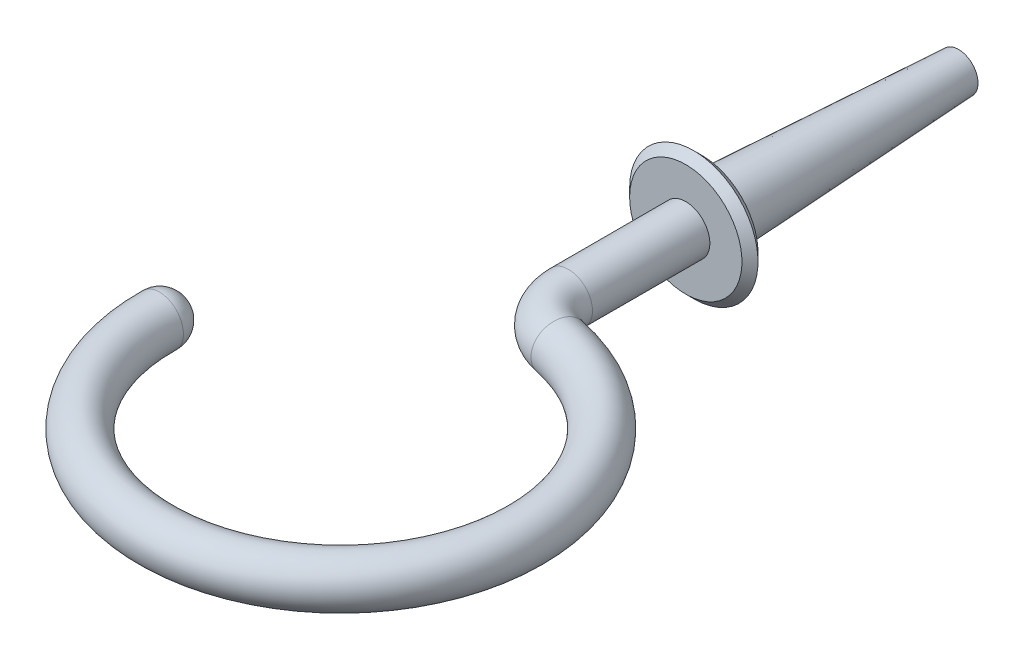
ISO-10303-21;
HEADER;
FILE_DESCRIPTION(('STEP AP214'),'2;1');
FILE_NAME('part.step','',(''),(''),'','','');
FILE_SCHEMA(('AUTOMOTIVE_DESIGN { 1 0 10303 214 1 1 1 1 }'));
ENDSEC;
DATA;
#1=APPLICATION_CONTEXT('core data for automotive mechanical design processes');
#2=APPLICATION_PROTOCOL_DEFINITION('international standard','automotive_design',2000,#1);
#3=PRODUCT_CONTEXT('',#1,'mechanical');
#4=PRODUCT('Part','Part','',(#3));
#5=PRODUCT_RELATED_PRODUCT_CATEGORY('part','',(#4));
#6=PRODUCT_DEFINITION_FORMATION('','',#4);
#7=PRODUCT_DEFINITION_CONTEXT('part definition',#1,'design');
#8=PRODUCT_DEFINITION('design','',#6,#7);
#9=PRODUCT_DEFINITION_SHAPE('','',#8);
#10=(LENGTH_UNIT() NAMED_UNIT(*) SI_UNIT(.MILLI.,.METRE.));
#11=(NAMED_UNIT(*) PLANE_ANGLE_UNIT() SI_UNIT($,.RADIAN.));
#12=(NAMED_UNIT(*) SI_UNIT($,.STERADIAN.) SOLID_ANGLE_UNIT());
#13=UNCERTAINTY_MEASURE_WITH_UNIT(LENGTH_MEASURE(1.E-05),#10,'distance_accuracy_value','');
#14=(GEOMETRIC_REPRESENTATION_CONTEXT(3) GLOBAL_UNCERTAINTY_ASSIGNED_CONTEXT((#13)) GLOBAL_UNIT_ASSIGNED_CONTEXT((#10,
#11,#12)) REPRESENTATION_CONTEXT('',''));
#15=CARTESIAN_POINT('',(0.,0.,0.));
#16=DIRECTION('',(0.,0.,1.));
#17=DIRECTION('',(1.,0.,0.));
#18=AXIS2_PLACEMENT_3D('',#15,#16,#17);
#19=CARTESIAN_POINT('',(0.,0.,-1.));
#20=DIRECTION('',(0.,0.,-1.));
#21=DIRECTION('',(-1.,0.,0.));
#22=AXIS2_PLACEMENT_3D('',#19,#20,#21);
#23=PLANE('',#22);
#24=CARTESIAN_POINT('',(0.,0.,-1.));
#25=DIRECTION('',(0.,0.,-1.));
#26=DIRECTION('',(-1.,0.,0.));
#27=AXIS2_PLACEMENT_3D('',#24,#25,#26);
#28=CIRCLE('',#27,3.5);
#29=CARTESIAN_POINT('',(-3.5,0.,-1.));
#30=VERTEX_POINT('',#29);
#31=EDGE_CURVE('E50',#30,#30,#28,.T.);
#32=ORIENTED_EDGE('',*,*,#31,.T.);
#33=EDGE_LOOP('',(#32));
#34=FACE_BOUND('',#33,.T.);
#35=CARTESIAN_POINT('',(0.,0.,-1.));
#36=DIRECTION('',(0.,0.,-1.));
#37=DIRECTION('',(-1.,0.,0.));
#38=AXIS2_PLACEMENT_3D('',#35,#36,#37);
#39=CIRCLE('',#38,2.);
#40=CARTESIAN_POINT('',(-2.,0.,-1.));
#41=VERTEX_POINT('',#40);
#42=EDGE_CURVE('E63',#41,#41,#39,.T.);
#43=ORIENTED_EDGE('',*,*,#42,.F.);
#44=EDGE_LOOP('',(#43));
#45=FACE_BOUND('',#44,.T.);
#46=ADVANCED_FACE('F35',(#34,#45),#23,.T.);
#47=CARTESIAN_POINT('',(0.,0.,21.5));
#48=DIRECTION('',(0.,-1.,0.));
#49=DIRECTION('',(0.,0.,-1.));
#50=AXIS2_PLACEMENT_3D('',#47,#48,#49);
#51=TOROIDAL_SURFACE('',#50,11.5,1.5);
#52=CARTESIAN_POINT('',(2.37931034482759,0.,10.2488275151877));
#53=DIRECTION('',(0.978362824766283,0.,0.206896551724138));
#54=DIRECTION('',(0.206896551724138,0.,-0.978362824766283));
#55=AXIS2_PLACEMENT_3D('',#52,#53,#54);
#56=CIRCLE('',#55,1.5);
#57=CARTESIAN_POINT('',(2.68965517241379,0.,8.78128327803831));
#58=VERTEX_POINT('',#57);
#59=EDGE_CURVE('E79',#58,#58,#56,.T.);
#60=CARTESIAN_POINT('',(-11.4979042478238,0.,21.2804597807352));
#61=DIRECTION('',(0.0190904538491132,0.,-0.999817760680333));
#62=DIRECTION('',(-0.999817760680333,0.,-0.0190904538491132));
#63=AXIS2_PLACEMENT_3D('',#60,#61,#62);
#64=CIRCLE('',#63,1.5);
#65=CARTESIAN_POINT('',(-12.9976308888443,0.,21.2518240999615));
#66=VERTEX_POINT('',#65);
#67=EDGE_CURVE('E10',#66,#66,#64,.F.);
#68=CARTESIAN_POINT('',(0.,0.,21.5));
#69=DIRECTION('',(0.,-1.,0.));
#70=DIRECTION('',(0.,0.,-1.));
#71=AXIS2_PLACEMENT_3D('',#68,#69,#70);
#72=CIRCLE('',#71,13.);
#73=EDGE_CURVE('',#58,#66,#72,.T.);
#74=ORIENTED_EDGE('',*,*,#59,.T.);
#75=ORIENTED_EDGE('',*,*,#67,.T.);
#76=ORIENTED_EDGE('',*,*,#73,.T.);
#77=ORIENTED_EDGE('',*,*,#73,.F.);
#78=EDGE_LOOP('',(#74,#76,#75,#77));
#79=FACE_BOUND('',#78,.T.);
#80=ADVANCED_FACE('F106',(#79),#51,.T.);
#81=CARTESIAN_POINT('',(3.,0.,7.31373904088889));
#82=DIRECTION('',(0.,1.,0.));
#83=DIRECTION('',(0.,0.,1.));
#84=AXIS2_PLACEMENT_3D('',#81,#82,#83);
#85=TOROIDAL_SURFACE('',#84,3.,1.5);
#86=CARTESIAN_POINT('',(0.,0.,7.31373904088889));
#87=DIRECTION('',(0.,0.,1.));
#88=DIRECTION('',(1.,0.,0.));
#89=AXIS2_PLACEMENT_3D('',#86,#87,#88);
#90=CIRCLE('',#89,1.5);
#91=CARTESIAN_POINT('',(1.5,0.,7.31373904088889));
#92=VERTEX_POINT('',#91);
#93=EDGE_CURVE('E74',#92,#92,#90,.T.);
#94=ORIENTED_EDGE('',*,*,#93,.T.);
#95=EDGE_LOOP('',(#94));
#96=FACE_BOUND('',#95,.T.);
#97=ORIENTED_EDGE('',*,*,#59,.F.);
#98=EDGE_LOOP('',(#97));
#99=FACE_BOUND('',#98,.T.);
#100=ADVANCED_FACE('F112',(#96,#99),#85,.T.);
#101=CARTESIAN_POINT('',(0.,0.,7.31373904088889));
#102=DIRECTION('',(0.,0.,-1.));
#103=DIRECTION('',(-1.,0.,0.));
#104=AXIS2_PLACEMENT_3D('',#101,#102,#103);
#105=CYLINDRICAL_SURFACE('',#104,1.5);
#106=ORIENTED_EDGE('',*,*,#93,.F.);
#107=EDGE_LOOP('',(#106));
#108=FACE_BOUND('',#107,.T.);
#109=CARTESIAN_POINT('',(0.,0.,0.));
#110=DIRECTION('',(0.,0.,-1.));
#111=DIRECTION('',(-1.,0.,0.));
#112=AXIS2_PLACEMENT_3D('',#109,#110,#111);
#113=CIRCLE('',#112,1.5);
#114=CARTESIAN_POINT('',(-1.5,0.,0.));
#115=VERTEX_POINT('',#114);
#116=EDGE_CURVE('E68',#115,#115,#113,.T.);
#117=ORIENTED_EDGE('',*,*,#116,.F.);
#118=EDGE_LOOP('',(#117));
#119=FACE_BOUND('',#118,.T.);
#120=ADVANCED_FACE('F118',(#108,#119),#105,.T.);
#121=CARTESIAN_POINT('',(0.,0.,0.));
#122=DIRECTION('',(0.,0.,-1.));
#123=DIRECTION('',(-1.,0.,0.));
#124=AXIS2_PLACEMENT_3D('',#121,#122,#123);
#125=PLANE('',#124);
#126=CARTESIAN_POINT('',(0.,0.,0.));
#127=DIRECTION('',(0.,0.,-1.));
#128=DIRECTION('',(-1.,0.,0.));
#129=AXIS2_PLACEMENT_3D('',#126,#127,#128);
#130=CIRCLE('',#129,3.50000000000001);
#131=CARTESIAN_POINT('',(-3.50000000000001,0.,0.));
#132=VERTEX_POINT('',#131);
#133=EDGE_CURVE('E43',#132,#132,#130,.F.);
#134=ORIENTED_EDGE('',*,*,#133,.T.);
#135=EDGE_LOOP('',(#134));
#136=FACE_BOUND('',#135,.T.);
#137=ORIENTED_EDGE('',*,*,#116,.T.);
#138=EDGE_LOOP('',(#137));
#139=FACE_BOUND('',#138,.T.);
#140=ADVANCED_FACE('F103',(#136,#139),#125,.F.);
#141=CARTESIAN_POINT('',(0.,0.,-17.));
#142=DIRECTION('',(0.,0.,1.));
#143=DIRECTION('',(1.,0.,0.));
#144=AXIS2_PLACEMENT_3D('',#141,#142,#143);
#145=CYLINDRICAL_SURFACE('',#144,2.);
#146=CARTESIAN_POINT('',(0.,0.,-2.0000000000004));
#147=DIRECTION('',(0.,0.,-1.));
#148=DIRECTION('',(-1.,0.,0.));
#149=AXIS2_PLACEMENT_3D('',#146,#147,#148);
#150=CIRCLE('',#149,2.);
#151=CARTESIAN_POINT('',(-2.,0.,-2.0000000000004));
#152=VERTEX_POINT('',#151);
#153=EDGE_CURVE('E58',#152,#152,#150,.F.);
#154=ORIENTED_EDGE('',*,*,#153,.T.);
#155=EDGE_LOOP('',(#154));
#156=FACE_BOUND('',#155,.T.);
#157=ORIENTED_EDGE('',*,*,#42,.T.);
#158=EDGE_LOOP('',(#157));
#159=FACE_BOUND('',#158,.T.);
#160=ADVANCED_FACE('F88',(#156,#159),#145,.T.);
#161=CARTESIAN_POINT('',(0.,0.,-17.));
#162=DIRECTION('',(0.,0.,-1.));
#163=DIRECTION('',(-1.,0.,0.));
#164=AXIS2_PLACEMENT_3D('',#161,#162,#163);
#165=PLANE('',#164);
#166=CARTESIAN_POINT('',(0.,0.,-17.));
#167=DIRECTION('',(0.,0.,-1.));
#168=DIRECTION('',(-1.,0.,0.));
#169=AXIS2_PLACEMENT_3D('',#166,#167,#168);
#170=CIRCLE('',#169,1.21388331075444);
#171=CARTESIAN_POINT('',(-1.21388331075444,0.,-17.));
#172=VERTEX_POINT('',#171);
#173=EDGE_CURVE('E83',#172,#172,#170,.T.);
#174=ORIENTED_EDGE('',*,*,#173,.T.);
#175=EDGE_LOOP('',(#174));
#176=FACE_BOUND('',#175,.T.);
#177=ADVANCED_FACE('F94',(#176),#165,.T.);
#178=CARTESIAN_POINT('',(0.,0.,-17.));
#179=DIRECTION('',(0.,0.,1.));
#180=DIRECTION('',(1.,0.,0.));
#181=AXIS2_PLACEMENT_3D('',#178,#179,#180);
#182=CONICAL_SURFACE('',#181,1.21388331075444,0.0523598775598274);
#183=ORIENTED_EDGE('',*,*,#153,.F.);
#184=EDGE_LOOP('',(#183));
#185=FACE_BOUND('',#184,.T.);
#186=ORIENTED_EDGE('',*,*,#173,.F.);
#187=EDGE_LOOP('',(#186));
#188=FACE_BOUND('',#187,.T.);
#189=ADVANCED_FACE('F90',(#185,#188),#182,.T.);
#190=CARTESIAN_POINT('',(0.,0.,-0.499999999999997));
#191=DIRECTION('',(0.,0.,-1.));
#192=DIRECTION('',(-1.,0.,0.));
#193=AXIS2_PLACEMENT_3D('',#190,#191,#192);
#194=CONICAL_SURFACE('',#193,4.,0.785398163397441);
#195=ORIENTED_EDGE('',*,*,#133,.F.);
#196=EDGE_LOOP('',(#195));
#197=FACE_BOUND('',#196,.T.);
#198=CARTESIAN_POINT('',(0.,0.,-0.499999999999997));
#199=DIRECTION('',(0.,0.,-1.));
#200=DIRECTION('',(-1.,0.,0.));
#201=AXIS2_PLACEMENT_3D('',#198,#199,#200);
#202=CIRCLE('',#201,4.);
#203=CARTESIAN_POINT('',(-4.,0.,-0.499999999999997));
#204=VERTEX_POINT('',#203);
#205=EDGE_CURVE('E61',#204,#204,#202,.T.);
#206=ORIENTED_EDGE('',*,*,#205,.F.);
#207=EDGE_LOOP('',(#206));
#208=FACE_BOUND('',#207,.T.);
#209=ADVANCED_FACE('F93',(#197,#208),#194,.T.);
#210=CARTESIAN_POINT('',(0.,0.,-1.));
#211=DIRECTION('',(0.,0.,1.));
#212=DIRECTION('',(1.,0.,0.));
#213=AXIS2_PLACEMENT_3D('',#210,#211,#212);
#214=CONICAL_SURFACE('',#213,3.5,0.785398163397441);
#215=ORIENTED_EDGE('',*,*,#205,.T.);
#216=EDGE_LOOP('',(#215));
#217=FACE_BOUND('',#216,.T.);
#218=ORIENTED_EDGE('',*,*,#31,.F.);
#219=EDGE_LOOP('',(#218));
#220=FACE_BOUND('',#219,.T.);
#221=ADVANCED_FACE('F125',(#217,#220),#214,.T.);
#222=CARTESIAN_POINT('',(-11.4979042478238,0.,21.2804597807352));
#223=DIRECTION('',(0.,0.,1.));
#224=DIRECTION('',(1.,0.,0.));
#225=AXIS2_PLACEMENT_3D('',#222,#223,#224);
#226=SPHERICAL_SURFACE('',#225,1.5);
#227=CARTESIAN_POINT('',(-11.4979042478238,0.,21.2804597807352));
#228=DIRECTION('',(0.0190904538491132,0.,-0.999817760680333));
#229=DIRECTION('',(-0.999817760680333,0.,-0.0190904538491132));
#230=AXIS2_PLACEMENT_3D('',#227,#228,#229);
#231=SPHERICAL_SURFACE('',#230,1.5);
#232=ORIENTED_EDGE('',*,*,#67,.F.);
#233=EDGE_LOOP('',(#232));
#234=FACE_BOUND('',#233,.T.);
#235=ADVANCED_FACE('F37',(#234),#231,.T.);
#236=CLOSED_SHELL('',(#46,#80,#100,#120,#140,#160,#177,#189,#209,#221,#235));
#237=MANIFOLD_SOLID_BREP('B2',#236);
#238=ADVANCED_BREP_SHAPE_REPRESENTATION('',(#18,#237),#14);
#239=SHAPE_DEFINITION_REPRESENTATION(#9,#238);
ENDSEC;
END-ISO-10303-21;
